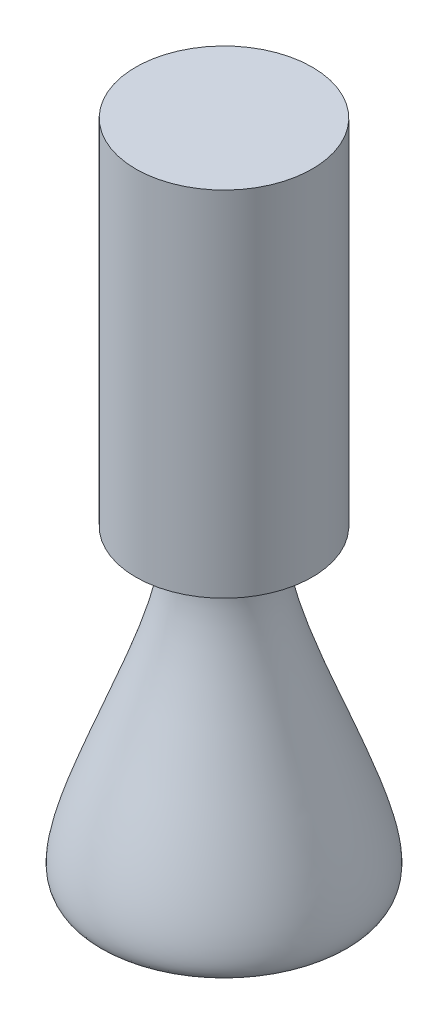
ISO-10303-21;
HEADER;
FILE_DESCRIPTION(('STEP AP214'),'2;1');
FILE_NAME('part.step','',(''),(''),'','','');
FILE_SCHEMA(('AUTOMOTIVE_DESIGN { 1 0 10303 214 1 1 1 1 }'));
ENDSEC;
DATA;
#1=APPLICATION_CONTEXT('core data for automotive mechanical design processes');
#2=APPLICATION_PROTOCOL_DEFINITION('international standard','automotive_design',2000,#1);
#3=PRODUCT_CONTEXT('',#1,'mechanical');
#4=PRODUCT('Part','Part','',(#3));
#5=PRODUCT_RELATED_PRODUCT_CATEGORY('part','',(#4));
#6=PRODUCT_DEFINITION_FORMATION('','',#4);
#7=PRODUCT_DEFINITION_CONTEXT('part definition',#1,'design');
#8=PRODUCT_DEFINITION('design','',#6,#7);
#9=PRODUCT_DEFINITION_SHAPE('','',#8);
#10=(LENGTH_UNIT() NAMED_UNIT(*) SI_UNIT(.MILLI.,.METRE.));
#11=(NAMED_UNIT(*) PLANE_ANGLE_UNIT() SI_UNIT($,.RADIAN.));
#12=(NAMED_UNIT(*) SI_UNIT($,.STERADIAN.) SOLID_ANGLE_UNIT());
#13=UNCERTAINTY_MEASURE_WITH_UNIT(LENGTH_MEASURE(1.E-05),#10,'distance_accuracy_value','');
#14=(GEOMETRIC_REPRESENTATION_CONTEXT(3) GLOBAL_UNCERTAINTY_ASSIGNED_CONTEXT((#13)) GLOBAL_UNIT_ASSIGNED_CONTEXT((#10,
#11,#12)) REPRESENTATION_CONTEXT('',''));
#15=CARTESIAN_POINT('',(0.,0.,0.));
#16=DIRECTION('',(0.,0.,1.));
#17=DIRECTION('',(1.,0.,0.));
#18=AXIS2_PLACEMENT_3D('',#15,#16,#17);
#19=CARTESIAN_POINT('',(12.2351094894685,91.2158357515236,0.));
#20=DIRECTION('',(0.,1.,0.));
#21=DIRECTION('',(0.,0.,1.));
#22=AXIS2_PLACEMENT_3D('',#19,#20,#21);
#23=PLANE('',#22);
#24=CARTESIAN_POINT('',(0.,91.2158357515236,0.));
#25=DIRECTION('',(0.,-1.,0.));
#26=DIRECTION('',(0.,0.,-1.));
#27=AXIS2_PLACEMENT_3D('',#24,#25,#26);
#28=CIRCLE('',#27,12.2351094894685);
#29=CARTESIAN_POINT('',(0.,91.2158357515236,-12.2351094894685));
#30=VERTEX_POINT('',#29);
#31=EDGE_CURVE('E10',#30,#30,#28,.T.);
#32=ORIENTED_EDGE('',*,*,#31,.F.);
#33=EDGE_LOOP('',(#32));
#34=FACE_BOUND('',#33,.T.);
#35=ADVANCED_FACE('F34',(#34),#23,.T.);
#36=CARTESIAN_POINT('',(0.,0.,0.));
#37=DIRECTION('',(0.,-1.,0.));
#38=DIRECTION('',(0.,0.,-1.));
#39=AXIS2_PLACEMENT_3D('',#36,#37,#38);
#40=CYLINDRICAL_SURFACE('',#39,12.2351094894685);
#41=ORIENTED_EDGE('',*,*,#31,.T.);
#42=EDGE_LOOP('',(#41));
#43=FACE_BOUND('',#42,.T.);
#44=CARTESIAN_POINT('',(0.,42.2158357515236,0.));
#45=DIRECTION('',(0.,-1.,0.));
#46=DIRECTION('',(0.,0.,-1.));
#47=AXIS2_PLACEMENT_3D('',#44,#45,#46);
#48=CIRCLE('',#47,12.2351094894685);
#49=CARTESIAN_POINT('',(0.,42.2158357515236,-12.2351094894685));
#50=VERTEX_POINT('',#49);
#51=EDGE_CURVE('E40',#50,#50,#48,.T.);
#52=ORIENTED_EDGE('',*,*,#51,.F.);
#53=EDGE_LOOP('',(#52));
#54=FACE_BOUND('',#53,.T.);
#55=ADVANCED_FACE('F61',(#43,#54),#40,.T.);
#56=CARTESIAN_POINT('',(17.,0.,0.));
#57=CARTESIAN_POINT('',(21.0678434702916,5.58610434510946,0.));
#58=CARTESIAN_POINT('',(-4.64460765478603,47.4476675980654,0.));
#59=CARTESIAN_POINT('',(12.2351094894685,42.2158357515236,0.));
#60=B_SPLINE_CURVE_WITH_KNOTS('',3,(#56,#57,#58,#59),.UNSPECIFIED.,.F.,.F.,(4,4),(0.,1.),.UNSPECIFIED.);
#61=CARTESIAN_POINT('',(0.,0.,0.));
#62=DIRECTION('',(0.,-1.,0.));
#63=AXIS1_PLACEMENT('',#61,#62);
#64=SURFACE_OF_REVOLUTION('',#60,#63);
#65=ORIENTED_EDGE('',*,*,#51,.T.);
#66=EDGE_LOOP('',(#65));
#67=FACE_BOUND('',#66,.T.);
#68=CARTESIAN_POINT('',(0.,0.,0.));
#69=DIRECTION('',(0.,-1.,0.));
#70=DIRECTION('',(0.,0.,-1.));
#71=AXIS2_PLACEMENT_3D('',#68,#69,#70);
#72=CIRCLE('',#71,17.);
#73=CARTESIAN_POINT('',(0.,0.,-17.));
#74=VERTEX_POINT('',#73);
#75=EDGE_CURVE('E44',#74,#74,#72,.T.);
#76=ORIENTED_EDGE('',*,*,#75,.F.);
#77=EDGE_LOOP('',(#76));
#78=FACE_BOUND('',#77,.T.);
#79=ADVANCED_FACE('F57',(#67,#78),#64,.F.);
#80=CARTESIAN_POINT('',(0.,0.,0.));
#81=DIRECTION('',(0.,-1.,0.));
#82=DIRECTION('',(0.,0.,-1.));
#83=AXIS2_PLACEMENT_3D('',#80,#81,#82);
#84=PLANE('',#83);
#85=ORIENTED_EDGE('',*,*,#75,.T.);
#86=EDGE_LOOP('',(#85));
#87=FACE_BOUND('',#86,.T.);
#88=ADVANCED_FACE('F60',(#87),#84,.T.);
#89=CLOSED_SHELL('',(#35,#55,#79,#88));
#90=MANIFOLD_SOLID_BREP('B2',#89);
#91=ADVANCED_BREP_SHAPE_REPRESENTATION('',(#18,#90),#14);
#92=SHAPE_DEFINITION_REPRESENTATION(#9,#91);
ENDSEC;
END-ISO-10303-21;
